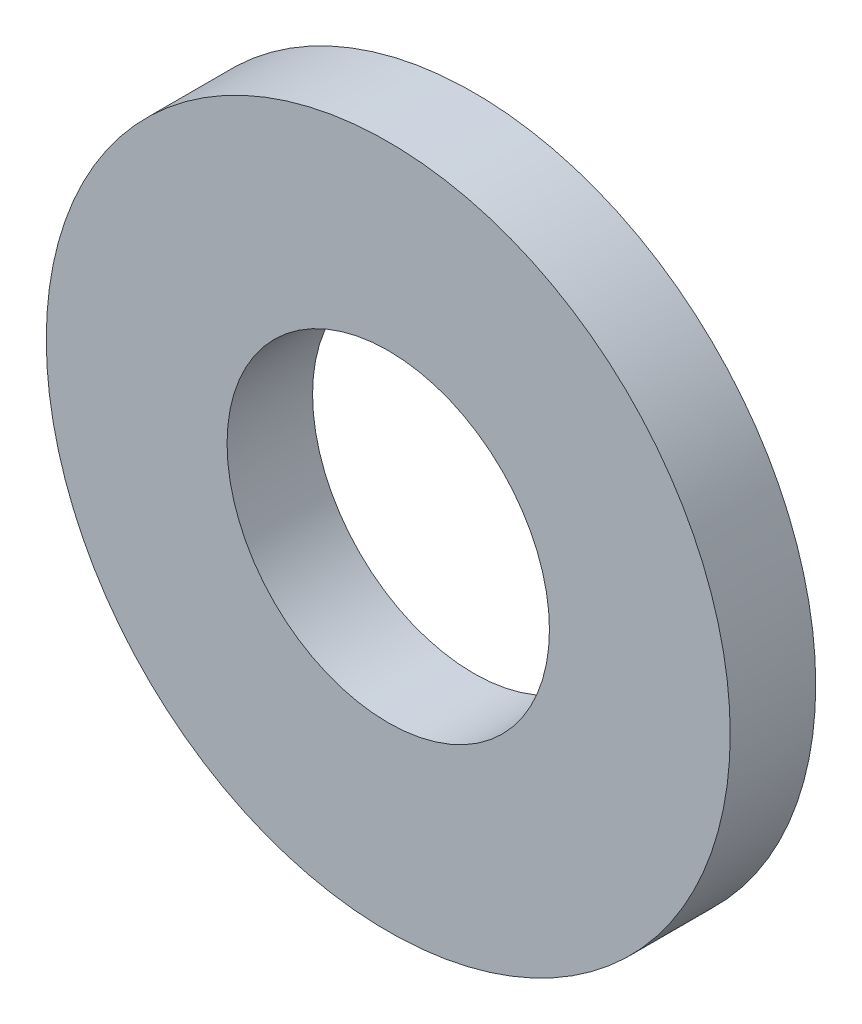
ISO-10303-21;
HEADER;
FILE_DESCRIPTION(('STEP AP214'),'2;1');
FILE_NAME('part.step','',(''),(''),'','','');
FILE_SCHEMA(('AUTOMOTIVE_DESIGN { 1 0 10303 214 1 1 1 1 }'));
ENDSEC;
DATA;
#1=APPLICATION_CONTEXT('core data for automotive mechanical design processes');
#2=APPLICATION_PROTOCOL_DEFINITION('international standard','automotive_design',2000,#1);
#3=PRODUCT_CONTEXT('',#1,'mechanical');
#4=PRODUCT('Part','Part','',(#3));
#5=PRODUCT_RELATED_PRODUCT_CATEGORY('part','',(#4));
#6=PRODUCT_DEFINITION_FORMATION('','',#4);
#7=PRODUCT_DEFINITION_CONTEXT('part definition',#1,'design');
#8=PRODUCT_DEFINITION('design','',#6,#7);
#9=PRODUCT_DEFINITION_SHAPE('','',#8);
#10=(LENGTH_UNIT() NAMED_UNIT(*) SI_UNIT(.MILLI.,.METRE.));
#11=(NAMED_UNIT(*) PLANE_ANGLE_UNIT() SI_UNIT($,.RADIAN.));
#12=(NAMED_UNIT(*) SI_UNIT($,.STERADIAN.) SOLID_ANGLE_UNIT());
#13=UNCERTAINTY_MEASURE_WITH_UNIT(LENGTH_MEASURE(1.E-05),#10,'distance_accuracy_value','');
#14=(GEOMETRIC_REPRESENTATION_CONTEXT(3) GLOBAL_UNCERTAINTY_ASSIGNED_CONTEXT((#13)) GLOBAL_UNIT_ASSIGNED_CONTEXT((#10,
#11,#12)) REPRESENTATION_CONTEXT('',''));
#15=CARTESIAN_POINT('',(0.,0.,0.));
#16=DIRECTION('',(0.,0.,1.));
#17=DIRECTION('',(1.,0.,0.));
#18=AXIS2_PLACEMENT_3D('',#15,#16,#17);
#19=CARTESIAN_POINT('',(0.,0.,1.5875));
#20=DIRECTION('',(0.,0.,1.));
#21=DIRECTION('',(1.,0.,0.));
#22=AXIS2_PLACEMENT_3D('',#19,#20,#21);
#23=PLANE('',#22);
#24=CARTESIAN_POINT('',(0.,0.,1.5875));
#25=DIRECTION('',(0.,0.,1.));
#26=DIRECTION('',(1.,0.,0.));
#27=AXIS2_PLACEMENT_3D('',#24,#25,#26);
#28=CIRCLE('',#27,6.35);
#29=CARTESIAN_POINT('',(6.35,0.,1.5875));
#30=VERTEX_POINT('',#29);
#31=EDGE_CURVE('E10',#30,#30,#28,.T.);
#32=ORIENTED_EDGE('',*,*,#31,.T.);
#33=EDGE_LOOP('',(#32));
#34=FACE_BOUND('',#33,.T.);
#35=CARTESIAN_POINT('',(0.,0.,1.5875));
#36=DIRECTION('',(0.,0.,1.));
#37=DIRECTION('',(1.,0.,0.));
#38=AXIS2_PLACEMENT_3D('',#35,#36,#37);
#39=CIRCLE('',#38,2.99299376);
#40=CARTESIAN_POINT('',(2.99299376,0.,1.5875));
#41=VERTEX_POINT('',#40);
#42=EDGE_CURVE('E41',#41,#41,#39,.T.);
#43=ORIENTED_EDGE('',*,*,#42,.F.);
#44=EDGE_LOOP('',(#43));
#45=FACE_BOUND('',#44,.T.);
#46=ADVANCED_FACE('F30',(#34,#45),#23,.T.);
#47=CARTESIAN_POINT('',(0.,0.,0.));
#48=DIRECTION('',(0.,0.,1.));
#49=DIRECTION('',(1.,0.,0.));
#50=AXIS2_PLACEMENT_3D('',#47,#48,#49);
#51=PLANE('',#50);
#52=CARTESIAN_POINT('',(0.,0.,0.));
#53=DIRECTION('',(0.,0.,1.));
#54=DIRECTION('',(1.,0.,0.));
#55=AXIS2_PLACEMENT_3D('',#52,#53,#54);
#56=CIRCLE('',#55,6.35);
#57=CARTESIAN_POINT('',(6.35,0.,0.));
#58=VERTEX_POINT('',#57);
#59=EDGE_CURVE('E34',#58,#58,#56,.T.);
#60=ORIENTED_EDGE('',*,*,#59,.F.);
#61=EDGE_LOOP('',(#60));
#62=FACE_BOUND('',#61,.T.);
#63=CARTESIAN_POINT('',(0.,0.,0.));
#64=DIRECTION('',(0.,0.,1.));
#65=DIRECTION('',(1.,0.,0.));
#66=AXIS2_PLACEMENT_3D('',#63,#64,#65);
#67=CIRCLE('',#66,2.99299376);
#68=CARTESIAN_POINT('',(2.99299376,0.,0.));
#69=VERTEX_POINT('',#68);
#70=EDGE_CURVE('E43',#69,#69,#67,.T.);
#71=ORIENTED_EDGE('',*,*,#70,.T.);
#72=EDGE_LOOP('',(#71));
#73=FACE_BOUND('',#72,.T.);
#74=ADVANCED_FACE('F53',(#62,#73),#51,.F.);
#75=CARTESIAN_POINT('',(0.,0.,1.5875));
#76=DIRECTION('',(0.,0.,-1.));
#77=DIRECTION('',(-1.,0.,0.));
#78=AXIS2_PLACEMENT_3D('',#75,#76,#77);
#79=CYLINDRICAL_SURFACE('',#78,6.35);
#80=ORIENTED_EDGE('',*,*,#31,.F.);
#81=EDGE_LOOP('',(#80));
#82=FACE_BOUND('',#81,.T.);
#83=ORIENTED_EDGE('',*,*,#59,.T.);
#84=EDGE_LOOP('',(#83));
#85=FACE_BOUND('',#84,.T.);
#86=ADVANCED_FACE('F32',(#82,#85),#79,.T.);
#87=CARTESIAN_POINT('',(0.,0.,1.5875));
#88=DIRECTION('',(0.,0.,-1.));
#89=DIRECTION('',(-1.,0.,0.));
#90=AXIS2_PLACEMENT_3D('',#87,#88,#89);
#91=CYLINDRICAL_SURFACE('',#90,2.99299376);
#92=ORIENTED_EDGE('',*,*,#42,.T.);
#93=EDGE_LOOP('',(#92));
#94=FACE_BOUND('',#93,.T.);
#95=ORIENTED_EDGE('',*,*,#70,.F.);
#96=EDGE_LOOP('',(#95));
#97=FACE_BOUND('',#96,.T.);
#98=ADVANCED_FACE('F49',(#94,#97),#91,.F.);
#99=CLOSED_SHELL('',(#46,#74,#86,#98));
#100=MANIFOLD_SOLID_BREP('B2',#99);
#101=ADVANCED_BREP_SHAPE_REPRESENTATION('',(#18,#100),#14);
#102=SHAPE_DEFINITION_REPRESENTATION(#9,#101);
ENDSEC;
END-ISO-10303-21;
